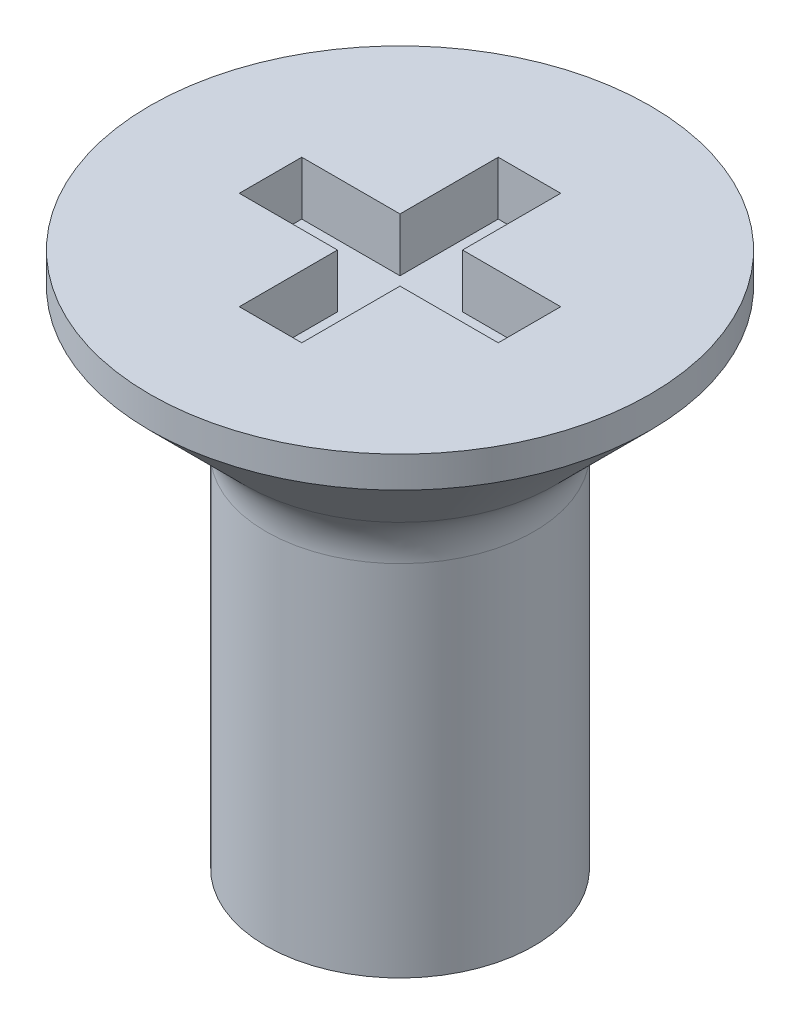
ISO-10303-21;
HEADER;
FILE_DESCRIPTION(('STEP AP214'),'2;1');
FILE_NAME('part.step','',(''),(''),'','','');
FILE_SCHEMA(('AUTOMOTIVE_DESIGN { 1 0 10303 214 1 1 1 1 }'));
ENDSEC;
DATA;
#1=APPLICATION_CONTEXT('core data for automotive mechanical design processes');
#2=APPLICATION_PROTOCOL_DEFINITION('international standard','automotive_design',2000,#1);
#3=PRODUCT_CONTEXT('',#1,'mechanical');
#4=PRODUCT('Part','Part','',(#3));
#5=PRODUCT_RELATED_PRODUCT_CATEGORY('part','',(#4));
#6=PRODUCT_DEFINITION_FORMATION('','',#4);
#7=PRODUCT_DEFINITION_CONTEXT('part definition',#1,'design');
#8=PRODUCT_DEFINITION('design','',#6,#7);
#9=PRODUCT_DEFINITION_SHAPE('','',#8);
#10=(LENGTH_UNIT() NAMED_UNIT(*) SI_UNIT(.MILLI.,.METRE.));
#11=(NAMED_UNIT(*) PLANE_ANGLE_UNIT() SI_UNIT($,.RADIAN.));
#12=(NAMED_UNIT(*) SI_UNIT($,.STERADIAN.) SOLID_ANGLE_UNIT());
#13=UNCERTAINTY_MEASURE_WITH_UNIT(LENGTH_MEASURE(1.E-05),#10,'distance_accuracy_value','');
#14=(GEOMETRIC_REPRESENTATION_CONTEXT(3) GLOBAL_UNCERTAINTY_ASSIGNED_CONTEXT((#13)) GLOBAL_UNIT_ASSIGNED_CONTEXT((#10,
#11,#12)) REPRESENTATION_CONTEXT('',''));
#15=CARTESIAN_POINT('',(0.,0.,0.));
#16=DIRECTION('',(0.,0.,1.));
#17=DIRECTION('',(1.,0.,0.));
#18=AXIS2_PLACEMENT_3D('',#15,#16,#17);
#19=CARTESIAN_POINT('',(0.,6.,0.));
#20=DIRECTION('',(0.,1.,0.));
#21=DIRECTION('',(0.,0.,1.));
#22=AXIS2_PLACEMENT_3D('',#19,#20,#21);
#23=PLANE('',#22);
#24=CARTESIAN_POINT('',(0.,6.,0.));
#25=DIRECTION('',(0.,-1.,0.));
#26=DIRECTION('',(0.,0.,-1.));
#27=AXIS2_PLACEMENT_3D('',#24,#25,#26);
#28=CIRCLE('',#27,2.8);
#29=CARTESIAN_POINT('',(0.,6.,-2.8));
#30=VERTEX_POINT('',#29);
#31=EDGE_CURVE('E215',#30,#30,#28,.T.);
#32=ORIENTED_EDGE('',*,*,#31,.F.);
#33=EDGE_LOOP('',(#32));
#34=FACE_BOUND('',#33,.T.);
#35=DIRECTION('',(-1.,0.,0.));
#36=VECTOR('',#35,1.);
#37=CARTESIAN_POINT('',(0.,6.,0.350000000000001));
#38=LINE('',#37,#36);
#39=CARTESIAN_POINT('',(-0.35,6.,0.350000000000001));
#40=VERTEX_POINT('',#39);
#41=CARTESIAN_POINT('',(-1.45,6.,0.350000000000001));
#42=VERTEX_POINT('',#41);
#43=EDGE_CURVE('E162',#40,#42,#38,.T.);
#44=ORIENTED_EDGE('',*,*,#43,.T.);
#45=DIRECTION('',(0.,0.,-1.));
#46=VECTOR('',#45,1.);
#47=CARTESIAN_POINT('',(-1.45,6.,0.));
#48=LINE('',#47,#46);
#49=CARTESIAN_POINT('',(-1.45,6.,-0.349999999999999));
#50=VERTEX_POINT('',#49);
#51=EDGE_CURVE('E48',#42,#50,#48,.T.);
#52=ORIENTED_EDGE('',*,*,#51,.T.);
#53=DIRECTION('',(-1.,0.,0.));
#54=VECTOR('',#53,1.);
#55=CARTESIAN_POINT('',(0.,6.,-0.349999999999999));
#56=LINE('',#55,#54);
#57=CARTESIAN_POINT('',(-0.35,6.,-0.349999999999999));
#58=VERTEX_POINT('',#57);
#59=EDGE_CURVE('E189',#58,#50,#56,.T.);
#60=ORIENTED_EDGE('',*,*,#59,.F.);
#61=DIRECTION('',(0.,0.,-1.));
#62=VECTOR('',#61,1.);
#63=CARTESIAN_POINT('',(-0.35,6.,0.));
#64=LINE('',#63,#62);
#65=CARTESIAN_POINT('',(-0.35,6.,-1.45));
#66=VERTEX_POINT('',#65);
#67=EDGE_CURVE('E187',#58,#66,#64,.T.);
#68=ORIENTED_EDGE('',*,*,#67,.T.);
#69=DIRECTION('',(-1.,0.,0.));
#70=VECTOR('',#69,1.);
#71=CARTESIAN_POINT('',(0.,6.,-1.45));
#72=LINE('',#71,#70);
#73=CARTESIAN_POINT('',(0.35,6.,-1.45));
#74=VERTEX_POINT('',#73);
#75=EDGE_CURVE('E146',#74,#66,#72,.T.);
#76=ORIENTED_EDGE('',*,*,#75,.F.);
#77=DIRECTION('',(0.,0.,-1.));
#78=VECTOR('',#77,1.);
#79=CARTESIAN_POINT('',(0.35,6.,0.));
#80=LINE('',#79,#78);
#81=CARTESIAN_POINT('',(0.35,6.,-0.349999999999999));
#82=VERTEX_POINT('',#81);
#83=EDGE_CURVE('E183',#82,#74,#80,.T.);
#84=ORIENTED_EDGE('',*,*,#83,.F.);
#85=DIRECTION('',(-1.,0.,0.));
#86=VECTOR('',#85,1.);
#87=CARTESIAN_POINT('',(0.,6.,-0.349999999999999));
#88=LINE('',#87,#86);
#89=CARTESIAN_POINT('',(1.45,6.,-0.349999999999999));
#90=VERTEX_POINT('',#89);
#91=EDGE_CURVE('E180',#90,#82,#88,.T.);
#92=ORIENTED_EDGE('',*,*,#91,.F.);
#93=DIRECTION('',(0.,0.,-1.));
#94=VECTOR('',#93,1.);
#95=CARTESIAN_POINT('',(1.45,6.,0.));
#96=LINE('',#95,#94);
#97=CARTESIAN_POINT('',(1.45,6.,0.350000000000001));
#98=VERTEX_POINT('',#97);
#99=EDGE_CURVE('E177',#98,#90,#96,.T.);
#100=ORIENTED_EDGE('',*,*,#99,.F.);
#101=DIRECTION('',(-1.,0.,0.));
#102=VECTOR('',#101,1.);
#103=CARTESIAN_POINT('',(0.,6.,0.350000000000001));
#104=LINE('',#103,#102);
#105=CARTESIAN_POINT('',(0.35,6.,0.350000000000001));
#106=VERTEX_POINT('',#105);
#107=EDGE_CURVE('E174',#98,#106,#104,.T.);
#108=ORIENTED_EDGE('',*,*,#107,.T.);
#109=DIRECTION('',(0.,0.,-1.));
#110=VECTOR('',#109,1.);
#111=CARTESIAN_POINT('',(0.35,6.,0.));
#112=LINE('',#111,#110);
#113=CARTESIAN_POINT('',(0.35,6.,1.45));
#114=VERTEX_POINT('',#113);
#115=EDGE_CURVE('E171',#114,#106,#112,.T.);
#116=ORIENTED_EDGE('',*,*,#115,.F.);
#117=DIRECTION('',(-1.,0.,0.));
#118=VECTOR('',#117,1.);
#119=CARTESIAN_POINT('',(0.,6.,1.45));
#120=LINE('',#119,#118);
#121=CARTESIAN_POINT('',(-0.35,6.,1.45));
#122=VERTEX_POINT('',#121);
#123=EDGE_CURVE('E168',#114,#122,#120,.T.);
#124=ORIENTED_EDGE('',*,*,#123,.T.);
#125=DIRECTION('',(0.,0.,-1.));
#126=VECTOR('',#125,1.);
#127=CARTESIAN_POINT('',(-0.35,6.,0.));
#128=LINE('',#127,#126);
#129=EDGE_CURVE('E165',#122,#40,#128,.T.);
#130=ORIENTED_EDGE('',*,*,#129,.T.);
#131=EDGE_LOOP('',(#44,#52,#60,#68,#76,#84,#92,#100,#108,#116,#124,#130));
#132=FACE_BOUND('',#131,.T.);
#133=ADVANCED_FACE('F33',(#34,#132),#23,.T.);
#134=CARTESIAN_POINT('',(1.5,0.,0.));
#135=DIRECTION('',(0.,-1.,0.));
#136=DIRECTION('',(0.,0.,-1.));
#137=AXIS2_PLACEMENT_3D('',#134,#135,#136);
#138=PLANE('',#137);
#139=CARTESIAN_POINT('',(0.,0.,0.));
#140=DIRECTION('',(0.,-1.,0.));
#141=DIRECTION('',(0.,0.,-1.));
#142=AXIS2_PLACEMENT_3D('',#139,#140,#141);
#143=CIRCLE('',#142,1.5);
#144=CARTESIAN_POINT('',(0.,0.,-1.5));
#145=VERTEX_POINT('',#144);
#146=EDGE_CURVE('E192',#145,#145,#143,.T.);
#147=ORIENTED_EDGE('',*,*,#146,.T.);
#148=EDGE_LOOP('',(#147));
#149=FACE_BOUND('',#148,.T.);
#150=ADVANCED_FACE('F236',(#149),#138,.T.);
#151=CARTESIAN_POINT('',(0.,0.,0.));
#152=DIRECTION('',(0.,-1.,0.));
#153=DIRECTION('',(0.,0.,-1.));
#154=AXIS2_PLACEMENT_3D('',#151,#152,#153);
#155=CYLINDRICAL_SURFACE('',#154,2.8);
#156=ORIENTED_EDGE('',*,*,#31,.T.);
#157=EDGE_LOOP('',(#156));
#158=FACE_BOUND('',#157,.T.);
#159=CARTESIAN_POINT('',(0.,5.65,0.));
#160=DIRECTION('',(0.,-1.,0.));
#161=DIRECTION('',(0.,0.,-1.));
#162=AXIS2_PLACEMENT_3D('',#159,#160,#161);
#163=CIRCLE('',#162,2.8);
#164=CARTESIAN_POINT('',(0.,5.65,-2.8));
#165=VERTEX_POINT('',#164);
#166=EDGE_CURVE('E212',#165,#165,#163,.T.);
#167=ORIENTED_EDGE('',*,*,#166,.F.);
#168=EDGE_LOOP('',(#167));
#169=FACE_BOUND('',#168,.T.);
#170=ADVANCED_FACE('F242',(#158,#169),#155,.T.);
#171=CARTESIAN_POINT('',(0.,4.35,0.));
#172=DIRECTION('',(0.,1.,0.));
#173=DIRECTION('',(0.,0.,1.));
#174=AXIS2_PLACEMENT_3D('',#171,#172,#173);
#175=CONICAL_SURFACE('',#174,1.5,0.78539816339745);
#176=CARTESIAN_POINT('',(0.,4.58431457505076,0.));
#177=DIRECTION('',(0.,1.,0.));
#178=DIRECTION('',(0.,0.,1.));
#179=AXIS2_PLACEMENT_3D('',#176,#177,#178);
#180=CIRCLE('',#179,1.73431457505076);
#181=CARTESIAN_POINT('',(0.,4.58431457505076,1.73431457505076));
#182=VERTEX_POINT('',#181);
#183=EDGE_CURVE('E11',#182,#182,#180,.T.);
#184=ORIENTED_EDGE('',*,*,#183,.T.);
#185=EDGE_LOOP('',(#184));
#186=FACE_BOUND('',#185,.T.);
#187=ORIENTED_EDGE('',*,*,#166,.T.);
#188=EDGE_LOOP('',(#187));
#189=FACE_BOUND('',#188,.T.);
#190=ADVANCED_FACE('F232',(#186,#189),#175,.T.);
#191=CARTESIAN_POINT('',(0.,0.,0.));
#192=DIRECTION('',(0.,-1.,0.));
#193=DIRECTION('',(0.,0.,-1.));
#194=AXIS2_PLACEMENT_3D('',#191,#192,#193);
#195=CYLINDRICAL_SURFACE('',#194,1.5);
#196=CARTESIAN_POINT('',(0.,4.01862915010152,0.));
#197=DIRECTION('',(0.,-1.,0.));
#198=DIRECTION('',(0.,0.,-1.));
#199=AXIS2_PLACEMENT_3D('',#196,#197,#198);
#200=CIRCLE('',#199,1.5);
#201=CARTESIAN_POINT('',(0.,4.01862915010152,-1.5));
#202=VERTEX_POINT('',#201);
#203=EDGE_CURVE('E41',#202,#202,#200,.T.);
#204=ORIENTED_EDGE('',*,*,#203,.T.);
#205=EDGE_LOOP('',(#204));
#206=FACE_BOUND('',#205,.T.);
#207=ORIENTED_EDGE('',*,*,#146,.F.);
#208=EDGE_LOOP('',(#207));
#209=FACE_BOUND('',#208,.T.);
#210=ADVANCED_FACE('F220',(#206,#209),#195,.T.);
#211=CARTESIAN_POINT('',(0.,4.01862915010152,0.));
#212=DIRECTION('',(0.,-1.,0.));
#213=DIRECTION('',(0.,0.,-1.));
#214=AXIS2_PLACEMENT_3D('',#211,#212,#213);
#215=TOROIDAL_SURFACE('',#214,2.3,0.8);
#216=ORIENTED_EDGE('',*,*,#183,.F.);
#217=EDGE_LOOP('',(#216));
#218=FACE_BOUND('',#217,.T.);
#219=ORIENTED_EDGE('',*,*,#203,.F.);
#220=EDGE_LOOP('',(#219));
#221=FACE_BOUND('',#220,.T.);
#222=ADVANCED_FACE('F35',(#218,#221),#215,.F.);
#223=CARTESIAN_POINT('',(-1.45,5.4,0.));
#224=DIRECTION('',(1.,0.,0.));
#225=DIRECTION('',(0.,0.,-1.));
#226=AXIS2_PLACEMENT_3D('',#223,#224,#225);
#227=PLANE('',#226);
#228=ORIENTED_EDGE('',*,*,#51,.F.);
#229=DIRECTION('',(0.,1.,0.));
#230=VECTOR('',#229,1.);
#231=CARTESIAN_POINT('',(-1.45,5.4,0.350000000000001));
#232=LINE('',#231,#230);
#233=CARTESIAN_POINT('',(-1.45,5.4,0.350000000000001));
#234=VERTEX_POINT('',#233);
#235=EDGE_CURVE('E160',#234,#42,#232,.T.);
#236=ORIENTED_EDGE('',*,*,#235,.F.);
#237=DIRECTION('',(0.,0.,-1.));
#238=VECTOR('',#237,1.);
#239=CARTESIAN_POINT('',(-1.45,5.4,0.));
#240=LINE('',#239,#238);
#241=CARTESIAN_POINT('',(-1.45,5.4,-0.349999999999999));
#242=VERTEX_POINT('',#241);
#243=EDGE_CURVE('E54',#234,#242,#240,.T.);
#244=ORIENTED_EDGE('',*,*,#243,.T.);
#245=DIRECTION('',(0.,1.,0.));
#246=VECTOR('',#245,1.);
#247=CARTESIAN_POINT('',(-1.45,5.4,-0.349999999999999));
#248=LINE('',#247,#246);
#249=EDGE_CURVE('E92',#242,#50,#248,.T.);
#250=ORIENTED_EDGE('',*,*,#249,.T.);
#251=EDGE_LOOP('',(#228,#236,#244,#250));
#252=FACE_BOUND('',#251,.T.);
#253=ADVANCED_FACE('F224',(#252),#227,.T.);
#254=CARTESIAN_POINT('',(0.,5.4,-0.349999999999999));
#255=DIRECTION('',(0.,0.,-1.));
#256=DIRECTION('',(-1.,0.,0.));
#257=AXIS2_PLACEMENT_3D('',#254,#255,#256);
#258=PLANE('',#257);
#259=ORIENTED_EDGE('',*,*,#59,.T.);
#260=ORIENTED_EDGE('',*,*,#249,.F.);
#261=DIRECTION('',(-1.,0.,0.));
#262=VECTOR('',#261,1.);
#263=CARTESIAN_POINT('',(0.,5.4,-0.349999999999999));
#264=LINE('',#263,#262);
#265=CARTESIAN_POINT('',(-0.35,5.4,-0.349999999999999));
#266=VERTEX_POINT('',#265);
#267=EDGE_CURVE('E138',#266,#242,#264,.T.);
#268=ORIENTED_EDGE('',*,*,#267,.F.);
#269=DIRECTION('',(0.,1.,0.));
#270=VECTOR('',#269,1.);
#271=CARTESIAN_POINT('',(-0.35,5.4,-0.349999999999999));
#272=LINE('',#271,#270);
#273=EDGE_CURVE('E133',#266,#58,#272,.T.);
#274=ORIENTED_EDGE('',*,*,#273,.T.);
#275=EDGE_LOOP('',(#259,#260,#268,#274));
#276=FACE_BOUND('',#275,.T.);
#277=ADVANCED_FACE('F230',(#276),#258,.F.);
#278=CARTESIAN_POINT('',(-0.35,5.4,0.));
#279=DIRECTION('',(1.,0.,0.));
#280=DIRECTION('',(0.,0.,-1.));
#281=AXIS2_PLACEMENT_3D('',#278,#279,#280);
#282=PLANE('',#281);
#283=ORIENTED_EDGE('',*,*,#67,.F.);
#284=ORIENTED_EDGE('',*,*,#273,.F.);
#285=DIRECTION('',(0.,0.,-1.));
#286=VECTOR('',#285,1.);
#287=CARTESIAN_POINT('',(-0.35,5.4,0.));
#288=LINE('',#287,#286);
#289=CARTESIAN_POINT('',(-0.35,5.4,-1.45));
#290=VERTEX_POINT('',#289);
#291=EDGE_CURVE('E127',#266,#290,#288,.T.);
#292=ORIENTED_EDGE('',*,*,#291,.T.);
#293=DIRECTION('',(0.,1.,0.));
#294=VECTOR('',#293,1.);
#295=CARTESIAN_POINT('',(-0.35,5.4,-1.45));
#296=LINE('',#295,#294);
#297=EDGE_CURVE('E131',#290,#66,#296,.T.);
#298=ORIENTED_EDGE('',*,*,#297,.T.);
#299=EDGE_LOOP('',(#283,#284,#292,#298));
#300=FACE_BOUND('',#299,.T.);
#301=ADVANCED_FACE('F130',(#300),#282,.T.);
#302=CARTESIAN_POINT('',(0.,5.4,-1.45));
#303=DIRECTION('',(0.,0.,-1.));
#304=DIRECTION('',(-1.,0.,0.));
#305=AXIS2_PLACEMENT_3D('',#302,#303,#304);
#306=PLANE('',#305);
#307=ORIENTED_EDGE('',*,*,#75,.T.);
#308=ORIENTED_EDGE('',*,*,#297,.F.);
#309=DIRECTION('',(-1.,0.,0.));
#310=VECTOR('',#309,1.);
#311=CARTESIAN_POINT('',(0.,5.4,-1.45));
#312=LINE('',#311,#310);
#313=CARTESIAN_POINT('',(0.35,5.4,-1.45));
#314=VERTEX_POINT('',#313);
#315=EDGE_CURVE('E139',#314,#290,#312,.T.);
#316=ORIENTED_EDGE('',*,*,#315,.F.);
#317=DIRECTION('',(0.,1.,0.));
#318=VECTOR('',#317,1.);
#319=CARTESIAN_POINT('',(0.35,5.4,-1.45));
#320=LINE('',#319,#318);
#321=EDGE_CURVE('E148',#314,#74,#320,.T.);
#322=ORIENTED_EDGE('',*,*,#321,.T.);
#323=EDGE_LOOP('',(#307,#308,#316,#322));
#324=FACE_BOUND('',#323,.T.);
#325=ADVANCED_FACE('F143',(#324),#306,.F.);
#326=CARTESIAN_POINT('',(0.35,5.4,0.));
#327=DIRECTION('',(1.,0.,0.));
#328=DIRECTION('',(0.,0.,-1.));
#329=AXIS2_PLACEMENT_3D('',#326,#327,#328);
#330=PLANE('',#329);
#331=ORIENTED_EDGE('',*,*,#83,.T.);
#332=ORIENTED_EDGE('',*,*,#321,.F.);
#333=DIRECTION('',(0.,0.,-1.));
#334=VECTOR('',#333,1.);
#335=CARTESIAN_POINT('',(0.35,5.4,0.));
#336=LINE('',#335,#334);
#337=CARTESIAN_POINT('',(0.35,5.4,-0.349999999999999));
#338=VERTEX_POINT('',#337);
#339=EDGE_CURVE('E153',#338,#314,#336,.T.);
#340=ORIENTED_EDGE('',*,*,#339,.F.);
#341=DIRECTION('',(0.,1.,0.));
#342=VECTOR('',#341,1.);
#343=CARTESIAN_POINT('',(0.35,5.4,-0.349999999999999));
#344=LINE('',#343,#342);
#345=EDGE_CURVE('E195',#338,#82,#344,.T.);
#346=ORIENTED_EDGE('',*,*,#345,.T.);
#347=EDGE_LOOP('',(#331,#332,#340,#346));
#348=FACE_BOUND('',#347,.T.);
#349=ADVANCED_FACE('F279',(#348),#330,.F.);
#350=CARTESIAN_POINT('',(0.,5.4,-0.349999999999999));
#351=DIRECTION('',(0.,0.,-1.));
#352=DIRECTION('',(-1.,0.,0.));
#353=AXIS2_PLACEMENT_3D('',#350,#351,#352);
#354=PLANE('',#353);
#355=ORIENTED_EDGE('',*,*,#91,.T.);
#356=ORIENTED_EDGE('',*,*,#345,.F.);
#357=DIRECTION('',(-1.,0.,0.));
#358=VECTOR('',#357,1.);
#359=CARTESIAN_POINT('',(0.,5.4,-0.349999999999999));
#360=LINE('',#359,#358);
#361=CARTESIAN_POINT('',(1.45,5.4,-0.349999999999999));
#362=VERTEX_POINT('',#361);
#363=EDGE_CURVE('E155',#362,#338,#360,.T.);
#364=ORIENTED_EDGE('',*,*,#363,.F.);
#365=DIRECTION('',(0.,1.,0.));
#366=VECTOR('',#365,1.);
#367=CARTESIAN_POINT('',(1.45,5.4,-0.349999999999999));
#368=LINE('',#367,#366);
#369=EDGE_CURVE('E197',#362,#90,#368,.T.);
#370=ORIENTED_EDGE('',*,*,#369,.T.);
#371=EDGE_LOOP('',(#355,#356,#364,#370));
#372=FACE_BOUND('',#371,.T.);
#373=ADVANCED_FACE('F275',(#372),#354,.F.);
#374=CARTESIAN_POINT('',(1.45,5.4,0.));
#375=DIRECTION('',(1.,0.,0.));
#376=DIRECTION('',(0.,0.,-1.));
#377=AXIS2_PLACEMENT_3D('',#374,#375,#376);
#378=PLANE('',#377);
#379=ORIENTED_EDGE('',*,*,#99,.T.);
#380=ORIENTED_EDGE('',*,*,#369,.F.);
#381=DIRECTION('',(0.,0.,-1.));
#382=VECTOR('',#381,1.);
#383=CARTESIAN_POINT('',(1.45,5.4,0.));
#384=LINE('',#383,#382);
#385=CARTESIAN_POINT('',(1.45,5.4,0.350000000000001));
#386=VERTEX_POINT('',#385);
#387=EDGE_CURVE('E427',#386,#362,#384,.T.);
#388=ORIENTED_EDGE('',*,*,#387,.F.);
#389=DIRECTION('',(0.,1.,0.));
#390=VECTOR('',#389,1.);
#391=CARTESIAN_POINT('',(1.45,5.4,0.350000000000001));
#392=LINE('',#391,#390);
#393=EDGE_CURVE('E199',#386,#98,#392,.T.);
#394=ORIENTED_EDGE('',*,*,#393,.T.);
#395=EDGE_LOOP('',(#379,#380,#388,#394));
#396=FACE_BOUND('',#395,.T.);
#397=ADVANCED_FACE('F271',(#396),#378,.F.);
#398=CARTESIAN_POINT('',(0.,5.4,0.350000000000001));
#399=DIRECTION('',(0.,0.,-1.));
#400=DIRECTION('',(-1.,0.,0.));
#401=AXIS2_PLACEMENT_3D('',#398,#399,#400);
#402=PLANE('',#401);
#403=ORIENTED_EDGE('',*,*,#107,.F.);
#404=ORIENTED_EDGE('',*,*,#393,.F.);
#405=DIRECTION('',(-1.,0.,0.));
#406=VECTOR('',#405,1.);
#407=CARTESIAN_POINT('',(0.,5.4,0.350000000000001));
#408=LINE('',#407,#406);
#409=CARTESIAN_POINT('',(0.35,5.4,0.350000000000001));
#410=VERTEX_POINT('',#409);
#411=EDGE_CURVE('E425',#386,#410,#408,.T.);
#412=ORIENTED_EDGE('',*,*,#411,.T.);
#413=DIRECTION('',(0.,1.,0.));
#414=VECTOR('',#413,1.);
#415=CARTESIAN_POINT('',(0.35,5.4,0.350000000000001));
#416=LINE('',#415,#414);
#417=EDGE_CURVE('E201',#410,#106,#416,.T.);
#418=ORIENTED_EDGE('',*,*,#417,.T.);
#419=EDGE_LOOP('',(#403,#404,#412,#418));
#420=FACE_BOUND('',#419,.T.);
#421=ADVANCED_FACE('F267',(#420),#402,.T.);
#422=CARTESIAN_POINT('',(0.35,5.4,0.));
#423=DIRECTION('',(1.,0.,0.));
#424=DIRECTION('',(0.,0.,-1.));
#425=AXIS2_PLACEMENT_3D('',#422,#423,#424);
#426=PLANE('',#425);
#427=ORIENTED_EDGE('',*,*,#115,.T.);
#428=ORIENTED_EDGE('',*,*,#417,.F.);
#429=DIRECTION('',(0.,0.,-1.));
#430=VECTOR('',#429,1.);
#431=CARTESIAN_POINT('',(0.35,5.4,0.));
#432=LINE('',#431,#430);
#433=CARTESIAN_POINT('',(0.35,5.4,1.45));
#434=VERTEX_POINT('',#433);
#435=EDGE_CURVE('E422',#434,#410,#432,.T.);
#436=ORIENTED_EDGE('',*,*,#435,.F.);
#437=DIRECTION('',(0.,1.,0.));
#438=VECTOR('',#437,1.);
#439=CARTESIAN_POINT('',(0.35,5.4,1.45));
#440=LINE('',#439,#438);
#441=EDGE_CURVE('E203',#434,#114,#440,.T.);
#442=ORIENTED_EDGE('',*,*,#441,.T.);
#443=EDGE_LOOP('',(#427,#428,#436,#442));
#444=FACE_BOUND('',#443,.T.);
#445=ADVANCED_FACE('F263',(#444),#426,.F.);
#446=CARTESIAN_POINT('',(0.,5.4,1.45));
#447=DIRECTION('',(0.,0.,-1.));
#448=DIRECTION('',(-1.,0.,0.));
#449=AXIS2_PLACEMENT_3D('',#446,#447,#448);
#450=PLANE('',#449);
#451=ORIENTED_EDGE('',*,*,#123,.F.);
#452=ORIENTED_EDGE('',*,*,#441,.F.);
#453=DIRECTION('',(-1.,0.,0.));
#454=VECTOR('',#453,1.);
#455=CARTESIAN_POINT('',(0.,5.4,1.45));
#456=LINE('',#455,#454);
#457=CARTESIAN_POINT('',(-0.35,5.4,1.45));
#458=VERTEX_POINT('',#457);
#459=EDGE_CURVE('E420',#434,#458,#456,.T.);
#460=ORIENTED_EDGE('',*,*,#459,.T.);
#461=DIRECTION('',(0.,1.,0.));
#462=VECTOR('',#461,1.);
#463=CARTESIAN_POINT('',(-0.35,5.4,1.45));
#464=LINE('',#463,#462);
#465=EDGE_CURVE('E205',#458,#122,#464,.T.);
#466=ORIENTED_EDGE('',*,*,#465,.T.);
#467=EDGE_LOOP('',(#451,#452,#460,#466));
#468=FACE_BOUND('',#467,.T.);
#469=ADVANCED_FACE('F259',(#468),#450,.T.);
#470=CARTESIAN_POINT('',(-0.35,5.4,0.));
#471=DIRECTION('',(1.,0.,0.));
#472=DIRECTION('',(0.,0.,-1.));
#473=AXIS2_PLACEMENT_3D('',#470,#471,#472);
#474=PLANE('',#473);
#475=ORIENTED_EDGE('',*,*,#129,.F.);
#476=ORIENTED_EDGE('',*,*,#465,.F.);
#477=DIRECTION('',(0.,0.,-1.));
#478=VECTOR('',#477,1.);
#479=CARTESIAN_POINT('',(-0.35,5.4,0.));
#480=LINE('',#479,#478);
#481=CARTESIAN_POINT('',(-0.35,5.4,0.350000000000001));
#482=VERTEX_POINT('',#481);
#483=EDGE_CURVE('E416',#458,#482,#480,.T.);
#484=ORIENTED_EDGE('',*,*,#483,.T.);
#485=DIRECTION('',(0.,1.,0.));
#486=VECTOR('',#485,1.);
#487=CARTESIAN_POINT('',(-0.35,5.4,0.350000000000001));
#488=LINE('',#487,#486);
#489=EDGE_CURVE('E207',#482,#40,#488,.T.);
#490=ORIENTED_EDGE('',*,*,#489,.T.);
#491=EDGE_LOOP('',(#475,#476,#484,#490));
#492=FACE_BOUND('',#491,.T.);
#493=ADVANCED_FACE('F256',(#492),#474,.T.);
#494=CARTESIAN_POINT('',(0.,5.4,0.350000000000001));
#495=DIRECTION('',(0.,0.,-1.));
#496=DIRECTION('',(-1.,0.,0.));
#497=AXIS2_PLACEMENT_3D('',#494,#495,#496);
#498=PLANE('',#497);
#499=ORIENTED_EDGE('',*,*,#43,.F.);
#500=ORIENTED_EDGE('',*,*,#489,.F.);
#501=DIRECTION('',(-1.,0.,0.));
#502=VECTOR('',#501,1.);
#503=CARTESIAN_POINT('',(0.,5.4,0.350000000000001));
#504=LINE('',#503,#502);
#505=EDGE_CURVE('E100',#482,#234,#504,.T.);
#506=ORIENTED_EDGE('',*,*,#505,.T.);
#507=ORIENTED_EDGE('',*,*,#235,.T.);
#508=EDGE_LOOP('',(#499,#500,#506,#507));
#509=FACE_BOUND('',#508,.T.);
#510=ADVANCED_FACE('F253',(#509),#498,.T.);
#511=CARTESIAN_POINT('',(0.,5.4,0.));
#512=DIRECTION('',(0.,1.,0.));
#513=DIRECTION('',(0.,0.,1.));
#514=AXIS2_PLACEMENT_3D('',#511,#512,#513);
#515=PLANE('',#514);
#516=ORIENTED_EDGE('',*,*,#243,.F.);
#517=ORIENTED_EDGE('',*,*,#505,.F.);
#518=ORIENTED_EDGE('',*,*,#483,.F.);
#519=ORIENTED_EDGE('',*,*,#459,.F.);
#520=ORIENTED_EDGE('',*,*,#435,.T.);
#521=ORIENTED_EDGE('',*,*,#411,.F.);
#522=ORIENTED_EDGE('',*,*,#387,.T.);
#523=ORIENTED_EDGE('',*,*,#363,.T.);
#524=ORIENTED_EDGE('',*,*,#339,.T.);
#525=ORIENTED_EDGE('',*,*,#315,.T.);
#526=ORIENTED_EDGE('',*,*,#291,.F.);
#527=ORIENTED_EDGE('',*,*,#267,.T.);
#528=EDGE_LOOP('',(#516,#517,#518,#519,#520,#521,#522,#523,#524,#525,#526,#527));
#529=FACE_BOUND('',#528,.T.);
#530=ADVANCED_FACE('F150',(#529),#515,.T.);
#531=CLOSED_SHELL('',(#133,#150,#170,#190,#210,#222,#253,#277,#301,#325,#349,#373,#397,#421,
#445,#469,#493,#510,#530));
#532=MANIFOLD_SOLID_BREP('B2',#531);
#533=ADVANCED_BREP_SHAPE_REPRESENTATION('',(#18,#532),#14);
#534=SHAPE_DEFINITION_REPRESENTATION(#9,#533);
ENDSEC;
END-ISO-10303-21;
